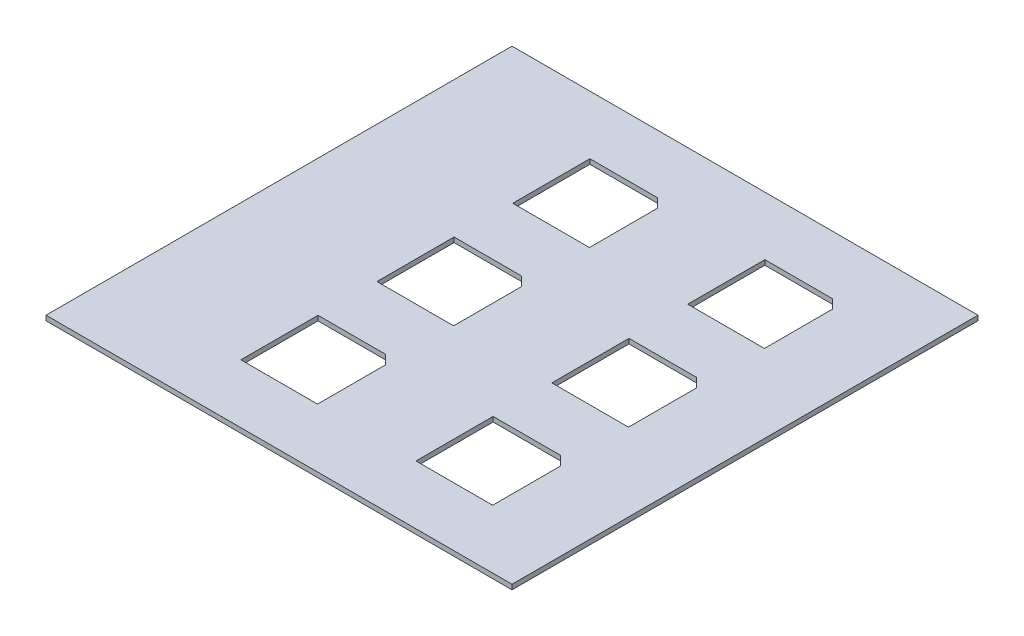
ISO-10303-21;
HEADER;
FILE_DESCRIPTION(('STEP AP214'),'2;1');
FILE_NAME('part.step','',(''),(''),'','','');
FILE_SCHEMA(('AUTOMOTIVE_DESIGN { 1 0 10303 214 1 1 1 1 }'));
ENDSEC;
DATA;
#1=APPLICATION_CONTEXT('core data for automotive mechanical design processes');
#2=APPLICATION_PROTOCOL_DEFINITION('international standard','automotive_design',2000,#1);
#3=PRODUCT_CONTEXT('',#1,'mechanical');
#4=PRODUCT('Part','Part','',(#3));
#5=PRODUCT_RELATED_PRODUCT_CATEGORY('part','',(#4));
#6=PRODUCT_DEFINITION_FORMATION('','',#4);
#7=PRODUCT_DEFINITION_CONTEXT('part definition',#1,'design');
#8=PRODUCT_DEFINITION('design','',#6,#7);
#9=PRODUCT_DEFINITION_SHAPE('','',#8);
#10=(LENGTH_UNIT() NAMED_UNIT(*) SI_UNIT(.MILLI.,.METRE.));
#11=(NAMED_UNIT(*) PLANE_ANGLE_UNIT() SI_UNIT($,.RADIAN.));
#12=(NAMED_UNIT(*) SI_UNIT($,.STERADIAN.) SOLID_ANGLE_UNIT());
#13=UNCERTAINTY_MEASURE_WITH_UNIT(LENGTH_MEASURE(1.E-05),#10,'distance_accuracy_value','');
#14=(GEOMETRIC_REPRESENTATION_CONTEXT(3) GLOBAL_UNCERTAINTY_ASSIGNED_CONTEXT((#13)) GLOBAL_UNIT_ASSIGNED_CONTEXT((#10,
#11,#12)) REPRESENTATION_CONTEXT('',''));
#15=CARTESIAN_POINT('',(0.,0.,0.));
#16=DIRECTION('',(0.,0.,1.));
#17=DIRECTION('',(1.,0.,0.));
#18=AXIS2_PLACEMENT_3D('',#15,#16,#17);
#19=CARTESIAN_POINT('',(0.,3.175,0.));
#20=DIRECTION('',(0.,-1.,0.));
#21=DIRECTION('',(0.,0.,-1.));
#22=AXIS2_PLACEMENT_3D('',#19,#20,#21);
#23=PLANE('',#22);
#24=DIRECTION('',(0.,0.,1.));
#25=VECTOR('',#24,1.);
#26=CARTESIAN_POINT('',(38.6181312538432,3.175,113.973933448569));
#27=LINE('',#26,#25);
#28=CARTESIAN_POINT('',(38.6181312538432,3.175,63.5156232839701));
#29=VERTEX_POINT('',#28);
#30=CARTESIAN_POINT('',(38.6181312538432,3.175,113.973933448569));
#31=VERTEX_POINT('',#30);
#32=EDGE_CURVE('E298',#29,#31,#27,.T.);
#33=ORIENTED_EDGE('',*,*,#32,.F.);
#34=DIRECTION('',(-1.,0.,0.));
#35=VECTOR('',#34,1.);
#36=CARTESIAN_POINT('',(38.6181312538432,3.175,63.5156232839701));
#37=LINE('',#36,#35);
#38=CARTESIAN_POINT('',(82.7586538566415,3.175,63.5156232839701));
#39=VERTEX_POINT('',#38);
#40=EDGE_CURVE('E308',#39,#29,#37,.T.);
#41=ORIENTED_EDGE('',*,*,#40,.F.);
#42=DIRECTION('',(-0.707106781186545,0.,-0.70710678118655));
#43=VECTOR('',#42,1.);
#44=CARTESIAN_POINT('',(82.7586538566415,3.175,63.5156232839701));
#45=LINE('',#44,#43);
#46=CARTESIAN_POINT('',(88.7566843659772,3.175,69.5136537933057));
#47=VERTEX_POINT('',#46);
#48=EDGE_CURVE('E305',#47,#39,#45,.T.);
#49=ORIENTED_EDGE('',*,*,#48,.F.);
#50=DIRECTION('',(0.,0.,-1.));
#51=VECTOR('',#50,1.);
#52=CARTESIAN_POINT('',(88.7566843659772,3.175,113.973933448569));
#53=LINE('',#52,#51);
#54=CARTESIAN_POINT('',(88.7566843659772,3.175,113.973933448569));
#55=VERTEX_POINT('',#54);
#56=EDGE_CURVE('E303',#55,#47,#53,.T.);
#57=ORIENTED_EDGE('',*,*,#56,.F.);
#58=DIRECTION('',(1.,0.,0.));
#59=VECTOR('',#58,1.);
#60=CARTESIAN_POINT('',(38.6181312538432,3.175,113.973933448569));
#61=LINE('',#60,#59);
#62=EDGE_CURVE('E300',#31,#55,#61,.T.);
#63=ORIENTED_EDGE('',*,*,#62,.F.);
#64=EDGE_LOOP('',(#33,#41,#49,#57,#63));
#65=FACE_BOUND('',#64,.T.);
#66=DIRECTION('',(0.,0.,1.));
#67=VECTOR('',#66,1.);
#68=CARTESIAN_POINT('',(-75.7681351800765,3.175,25.1141522078381));
#69=LINE('',#68,#67);
#70=CARTESIAN_POINT('',(-75.7681351800765,3.175,-25.3441579567605));
#71=VERTEX_POINT('',#70);
#72=CARTESIAN_POINT('',(-75.7681351800765,3.175,25.1141522078381));
#73=VERTEX_POINT('',#72);
#74=EDGE_CURVE('E374',#71,#73,#69,.T.);
#75=ORIENTED_EDGE('',*,*,#74,.F.);
#76=DIRECTION('',(-1.,0.,0.));
#77=VECTOR('',#76,1.);
#78=CARTESIAN_POINT('',(-75.7681351800765,3.175,-25.3441579567605));
#79=LINE('',#78,#77);
#80=CARTESIAN_POINT('',(-31.6276125772781,3.175,-25.3441579567605));
#81=VERTEX_POINT('',#80);
#82=EDGE_CURVE('E384',#81,#71,#79,.T.);
#83=ORIENTED_EDGE('',*,*,#82,.F.);
#84=DIRECTION('',(-0.707106781186545,0.,-0.70710678118655));
#85=VECTOR('',#84,1.);
#86=CARTESIAN_POINT('',(-31.6276125772781,3.175,-25.3441579567605));
#87=LINE('',#86,#85);
#88=CARTESIAN_POINT('',(-25.6295820679425,3.175,-19.3461274474248));
#89=VERTEX_POINT('',#88);
#90=EDGE_CURVE('E381',#89,#81,#87,.T.);
#91=ORIENTED_EDGE('',*,*,#90,.F.);
#92=DIRECTION('',(0.,0.,-1.));
#93=VECTOR('',#92,1.);
#94=CARTESIAN_POINT('',(-25.6295820679425,3.175,25.1141522078381));
#95=LINE('',#94,#93);
#96=CARTESIAN_POINT('',(-25.6295820679425,3.175,25.1141522078381));
#97=VERTEX_POINT('',#96);
#98=EDGE_CURVE('E379',#97,#89,#95,.T.);
#99=ORIENTED_EDGE('',*,*,#98,.F.);
#100=DIRECTION('',(1.,0.,0.));
#101=VECTOR('',#100,1.);
#102=CARTESIAN_POINT('',(-75.7681351800765,3.175,25.1141522078381));
#103=LINE('',#102,#101);
#104=EDGE_CURVE('E376',#73,#97,#103,.T.);
#105=ORIENTED_EDGE('',*,*,#104,.F.);
#106=EDGE_LOOP('',(#75,#83,#91,#99,#105));
#107=FACE_BOUND('',#106,.T.);
#108=DIRECTION('',(0.,0.,1.));
#109=VECTOR('',#108,1.);
#110=CARTESIAN_POINT('',(-75.6985006953668,3.175,-63.659947583233));
#111=LINE('',#110,#109);
#112=CARTESIAN_POINT('',(-75.6985006953668,3.175,-114.118257747832));
#113=VERTEX_POINT('',#112);
#114=CARTESIAN_POINT('',(-75.6985006953668,3.175,-63.659947583233));
#115=VERTEX_POINT('',#114);
#116=EDGE_CURVE('E450',#113,#115,#111,.T.);
#117=ORIENTED_EDGE('',*,*,#116,.F.);
#118=DIRECTION('',(-1.,0.,0.));
#119=VECTOR('',#118,1.);
#120=CARTESIAN_POINT('',(-75.6985006953668,3.175,-114.118257747832));
#121=LINE('',#120,#119);
#122=CARTESIAN_POINT('',(-31.5579780925685,3.175,-114.118257747832));
#123=VERTEX_POINT('',#122);
#124=EDGE_CURVE('E460',#123,#113,#121,.T.);
#125=ORIENTED_EDGE('',*,*,#124,.F.);
#126=DIRECTION('',(-0.707106781186545,0.,-0.70710678118655));
#127=VECTOR('',#126,1.);
#128=CARTESIAN_POINT('',(-31.5579780925685,3.175,-114.118257747832));
#129=LINE('',#128,#127);
#130=CARTESIAN_POINT('',(-25.5599475832329,3.175,-108.120227238496));
#131=VERTEX_POINT('',#130);
#132=EDGE_CURVE('E457',#131,#123,#129,.T.);
#133=ORIENTED_EDGE('',*,*,#132,.F.);
#134=DIRECTION('',(0.,0.,-1.));
#135=VECTOR('',#134,1.);
#136=CARTESIAN_POINT('',(-25.5599475832329,3.175,-63.659947583233));
#137=LINE('',#136,#135);
#138=CARTESIAN_POINT('',(-25.5599475832329,3.175,-63.659947583233));
#139=VERTEX_POINT('',#138);
#140=EDGE_CURVE('E455',#139,#131,#137,.T.);
#141=ORIENTED_EDGE('',*,*,#140,.F.);
#142=DIRECTION('',(1.,0.,0.));
#143=VECTOR('',#142,1.);
#144=CARTESIAN_POINT('',(-75.6985006953668,3.175,-63.659947583233));
#145=LINE('',#144,#143);
#146=EDGE_CURVE('E452',#115,#139,#145,.T.);
#147=ORIENTED_EDGE('',*,*,#146,.F.);
#148=EDGE_LOOP('',(#117,#125,#133,#141,#147));
#149=FACE_BOUND('',#148,.T.);
#150=DIRECTION('',(0.,0.,-1.));
#151=VECTOR('',#150,1.);
#152=CARTESIAN_POINT('',(139.859947583233,3.175,152.4));
#153=LINE('',#152,#151);
#154=CARTESIAN_POINT('',(139.859947583233,3.175,152.4));
#155=VERTEX_POINT('',#154);
#156=CARTESIAN_POINT('',(139.859947583233,3.175,-152.4));
#157=VERTEX_POINT('',#156);
#158=EDGE_CURVE('E488',#155,#157,#153,.T.);
#159=ORIENTED_EDGE('',*,*,#158,.T.);
#160=DIRECTION('',(-1.,0.,0.));
#161=VECTOR('',#160,1.);
#162=CARTESIAN_POINT('',(-164.940052416767,3.175,-152.4));
#163=LINE('',#162,#161);
#164=CARTESIAN_POINT('',(-164.940052416767,3.175,-152.4));
#165=VERTEX_POINT('',#164);
#166=EDGE_CURVE('E491',#157,#165,#163,.T.);
#167=ORIENTED_EDGE('',*,*,#166,.T.);
#168=DIRECTION('',(0.,0.,1.));
#169=VECTOR('',#168,1.);
#170=CARTESIAN_POINT('',(-164.940052416767,3.175,152.4));
#171=LINE('',#170,#169);
#172=CARTESIAN_POINT('',(-164.940052416767,3.175,152.4));
#173=VERTEX_POINT('',#172);
#174=EDGE_CURVE('E494',#165,#173,#171,.T.);
#175=ORIENTED_EDGE('',*,*,#174,.T.);
#176=DIRECTION('',(1.,0.,0.));
#177=VECTOR('',#176,1.);
#178=CARTESIAN_POINT('',(-164.940052416767,3.175,152.4));
#179=LINE('',#178,#177);
#180=EDGE_CURVE('E496',#173,#155,#179,.T.);
#181=ORIENTED_EDGE('',*,*,#180,.T.);
#182=EDGE_LOOP('',(#159,#167,#175,#181));
#183=FACE_BOUND('',#182,.T.);
#184=DIRECTION('',(0.,0.,1.));
#185=VECTOR('',#184,1.);
#186=CARTESIAN_POINT('',(38.7016696213254,3.175,-63.70387445682));
#187=LINE('',#186,#185);
#188=CARTESIAN_POINT('',(38.7016696213254,3.175,-114.162184621419));
#189=VERTEX_POINT('',#188);
#190=CARTESIAN_POINT('',(38.7016696213254,3.175,-63.70387445682));
#191=VERTEX_POINT('',#190);
#192=EDGE_CURVE('E412',#189,#191,#187,.T.);
#193=ORIENTED_EDGE('',*,*,#192,.F.);
#194=DIRECTION('',(-1.,0.,0.));
#195=VECTOR('',#194,1.);
#196=CARTESIAN_POINT('',(38.7016696213254,3.175,-114.162184621419));
#197=LINE('',#196,#195);
#198=CARTESIAN_POINT('',(82.8421922241237,3.175,-114.162184621419));
#199=VERTEX_POINT('',#198);
#200=EDGE_CURVE('E422',#199,#189,#197,.T.);
#201=ORIENTED_EDGE('',*,*,#200,.F.);
#202=DIRECTION('',(-0.707106781186545,0.,-0.70710678118655));
#203=VECTOR('',#202,1.);
#204=CARTESIAN_POINT('',(82.8421922241237,3.175,-114.162184621419));
#205=LINE('',#204,#203);
#206=CARTESIAN_POINT('',(88.8402227334593,3.175,-108.164154112083));
#207=VERTEX_POINT('',#206);
#208=EDGE_CURVE('E419',#207,#199,#205,.T.);
#209=ORIENTED_EDGE('',*,*,#208,.F.);
#210=DIRECTION('',(0.,0.,-1.));
#211=VECTOR('',#210,1.);
#212=CARTESIAN_POINT('',(88.8402227334593,3.175,-63.70387445682));
#213=LINE('',#212,#211);
#214=CARTESIAN_POINT('',(88.8402227334593,3.175,-63.70387445682));
#215=VERTEX_POINT('',#214);
#216=EDGE_CURVE('E417',#215,#207,#213,.T.);
#217=ORIENTED_EDGE('',*,*,#216,.F.);
#218=DIRECTION('',(1.,0.,0.));
#219=VECTOR('',#218,1.);
#220=CARTESIAN_POINT('',(38.7016696213254,3.175,-63.70387445682));
#221=LINE('',#220,#219);
#222=EDGE_CURVE('E414',#191,#215,#221,.T.);
#223=ORIENTED_EDGE('',*,*,#222,.F.);
#224=EDGE_LOOP('',(#193,#201,#209,#217,#223));
#225=FACE_BOUND('',#224,.T.);
#226=DIRECTION('',(0.,0.,1.));
#227=VECTOR('',#226,1.);
#228=CARTESIAN_POINT('',(38.837246674097,3.175,25.3138517502849));
#229=LINE('',#228,#227);
#230=CARTESIAN_POINT('',(38.837246674097,3.175,-25.1444584143138));
#231=VERTEX_POINT('',#230);
#232=CARTESIAN_POINT('',(38.837246674097,3.175,25.3138517502849));
#233=VERTEX_POINT('',#232);
#234=EDGE_CURVE('E336',#231,#233,#229,.T.);
#235=ORIENTED_EDGE('',*,*,#234,.F.);
#236=DIRECTION('',(-1.,0.,0.));
#237=VECTOR('',#236,1.);
#238=CARTESIAN_POINT('',(38.837246674097,3.175,-25.1444584143138));
#239=LINE('',#238,#237);
#240=CARTESIAN_POINT('',(82.9777692768953,3.175,-25.1444584143138));
#241=VERTEX_POINT('',#240);
#242=EDGE_CURVE('E346',#241,#231,#239,.T.);
#243=ORIENTED_EDGE('',*,*,#242,.F.);
#244=DIRECTION('',(-0.707106781186546,0.,-0.707106781186549));
#245=VECTOR('',#244,1.);
#246=CARTESIAN_POINT('',(82.9777692768953,3.175,-25.1444584143138));
#247=LINE('',#246,#245);
#248=CARTESIAN_POINT('',(88.975799786231,3.175,-19.1464279049781));
#249=VERTEX_POINT('',#248);
#250=EDGE_CURVE('E343',#249,#241,#247,.T.);
#251=ORIENTED_EDGE('',*,*,#250,.F.);
#252=DIRECTION('',(0.,0.,-1.));
#253=VECTOR('',#252,1.);
#254=CARTESIAN_POINT('',(88.975799786231,3.175,25.3138517502849));
#255=LINE('',#254,#253);
#256=CARTESIAN_POINT('',(88.975799786231,3.175,25.3138517502849));
#257=VERTEX_POINT('',#256);
#258=EDGE_CURVE('E341',#257,#249,#255,.T.);
#259=ORIENTED_EDGE('',*,*,#258,.F.);
#260=DIRECTION('',(1.,0.,0.));
#261=VECTOR('',#260,1.);
#262=CARTESIAN_POINT('',(38.837246674097,3.175,25.3138517502849));
#263=LINE('',#262,#261);
#264=EDGE_CURVE('E338',#233,#257,#263,.T.);
#265=ORIENTED_EDGE('',*,*,#264,.F.);
#266=EDGE_LOOP('',(#235,#243,#251,#259,#265));
#267=FACE_BOUND('',#266,.T.);
#268=DIRECTION('',(0.,0.,1.));
#269=VECTOR('',#268,1.);
#270=CARTESIAN_POINT('',(-75.9260776330106,3.175,113.955197725837));
#271=LINE('',#270,#269);
#272=CARTESIAN_POINT('',(-75.9260776330106,3.175,63.4968875612388));
#273=VERTEX_POINT('',#272);
#274=CARTESIAN_POINT('',(-75.9260776330106,3.175,113.955197725837));
#275=VERTEX_POINT('',#274);
#276=EDGE_CURVE('E254',#273,#275,#271,.T.);
#277=ORIENTED_EDGE('',*,*,#276,.F.);
#278=DIRECTION('',(-1.,0.,0.));
#279=VECTOR('',#278,1.);
#280=CARTESIAN_POINT('',(-75.9260776330106,3.175,63.4968875612388));
#281=LINE('',#280,#279);
#282=CARTESIAN_POINT('',(-31.7855550302123,3.175,63.4968875612388));
#283=VERTEX_POINT('',#282);
#284=EDGE_CURVE('E281',#283,#273,#281,.T.);
#285=ORIENTED_EDGE('',*,*,#284,.F.);
#286=DIRECTION('',(-0.707106781186545,0.,-0.70710678118655));
#287=VECTOR('',#286,1.);
#288=CARTESIAN_POINT('',(-31.7855550302123,3.175,63.4968875612388));
#289=LINE('',#288,#287);
#290=CARTESIAN_POINT('',(-25.7875245208766,3.175,69.4949180705745));
#291=VERTEX_POINT('',#290);
#292=EDGE_CURVE('E277',#291,#283,#289,.T.);
#293=ORIENTED_EDGE('',*,*,#292,.F.);
#294=DIRECTION('',(0.,0.,-1.));
#295=VECTOR('',#294,1.);
#296=CARTESIAN_POINT('',(-25.7875245208766,3.175,113.955197725837));
#297=LINE('',#296,#295);
#298=CARTESIAN_POINT('',(-25.7875245208766,3.175,113.955197725837));
#299=VERTEX_POINT('',#298);
#300=EDGE_CURVE('E275',#299,#291,#297,.T.);
#301=ORIENTED_EDGE('',*,*,#300,.F.);
#302=DIRECTION('',(1.,0.,0.));
#303=VECTOR('',#302,1.);
#304=CARTESIAN_POINT('',(-75.9260776330106,3.175,113.955197725837));
#305=LINE('',#304,#303);
#306=EDGE_CURVE('E262',#275,#299,#305,.T.);
#307=ORIENTED_EDGE('',*,*,#306,.F.);
#308=EDGE_LOOP('',(#277,#285,#293,#301,#307));
#309=FACE_BOUND('',#308,.T.);
#310=ADVANCED_FACE('F33',(#65,#107,#149,#183,#225,#267,#309),#23,.F.);
#311=CARTESIAN_POINT('',(0.,0.,0.));
#312=DIRECTION('',(0.,-1.,0.));
#313=DIRECTION('',(0.,0.,-1.));
#314=AXIS2_PLACEMENT_3D('',#311,#312,#313);
#315=PLANE('',#314);
#316=DIRECTION('',(0.,0.,-1.));
#317=VECTOR('',#316,1.);
#318=CARTESIAN_POINT('',(139.859947583233,0.,152.4));
#319=LINE('',#318,#317);
#320=CARTESIAN_POINT('',(139.859947583233,0.,152.4));
#321=VERTEX_POINT('',#320);
#322=CARTESIAN_POINT('',(139.859947583233,0.,-152.4));
#323=VERTEX_POINT('',#322);
#324=EDGE_CURVE('E487',#321,#323,#319,.T.);
#325=ORIENTED_EDGE('',*,*,#324,.F.);
#326=DIRECTION('',(1.,0.,0.));
#327=VECTOR('',#326,1.);
#328=CARTESIAN_POINT('',(-164.940052416767,0.,152.4));
#329=LINE('',#328,#327);
#330=CARTESIAN_POINT('',(-164.940052416767,0.,152.4));
#331=VERTEX_POINT('',#330);
#332=EDGE_CURVE('E492',#331,#321,#329,.T.);
#333=ORIENTED_EDGE('',*,*,#332,.F.);
#334=DIRECTION('',(0.,0.,1.));
#335=VECTOR('',#334,1.);
#336=CARTESIAN_POINT('',(-164.940052416767,0.,152.4));
#337=LINE('',#336,#335);
#338=CARTESIAN_POINT('',(-164.940052416767,0.,-152.4));
#339=VERTEX_POINT('',#338);
#340=EDGE_CURVE('E503',#339,#331,#337,.T.);
#341=ORIENTED_EDGE('',*,*,#340,.F.);
#342=DIRECTION('',(-1.,0.,0.));
#343=VECTOR('',#342,1.);
#344=CARTESIAN_POINT('',(-164.940052416767,0.,-152.4));
#345=LINE('',#344,#343);
#346=EDGE_CURVE('E501',#323,#339,#345,.T.);
#347=ORIENTED_EDGE('',*,*,#346,.F.);
#348=EDGE_LOOP('',(#325,#333,#341,#347));
#349=FACE_BOUND('',#348,.T.);
#350=DIRECTION('',(-1.,0.,0.));
#351=VECTOR('',#350,1.);
#352=CARTESIAN_POINT('',(-75.6985006953668,0.,-114.118257747832));
#353=LINE('',#352,#351);
#354=CARTESIAN_POINT('',(-31.5579780925685,0.,-114.118257747832));
#355=VERTEX_POINT('',#354);
#356=CARTESIAN_POINT('',(-75.6985006953668,0.,-114.118257747832));
#357=VERTEX_POINT('',#356);
#358=EDGE_CURVE('E453',#355,#357,#353,.T.);
#359=ORIENTED_EDGE('',*,*,#358,.T.);
#360=DIRECTION('',(0.,0.,1.));
#361=VECTOR('',#360,1.);
#362=CARTESIAN_POINT('',(-75.6985006953668,0.,-63.659947583233));
#363=LINE('',#362,#361);
#364=CARTESIAN_POINT('',(-75.6985006953668,0.,-63.659947583233));
#365=VERTEX_POINT('',#364);
#366=EDGE_CURVE('E449',#357,#365,#363,.T.);
#367=ORIENTED_EDGE('',*,*,#366,.T.);
#368=DIRECTION('',(1.,0.,0.));
#369=VECTOR('',#368,1.);
#370=CARTESIAN_POINT('',(-75.6985006953668,0.,-63.659947583233));
#371=LINE('',#370,#369);
#372=CARTESIAN_POINT('',(-25.5599475832329,0.,-63.659947583233));
#373=VERTEX_POINT('',#372);
#374=EDGE_CURVE('E465',#365,#373,#371,.T.);
#375=ORIENTED_EDGE('',*,*,#374,.T.);
#376=DIRECTION('',(0.,0.,-1.));
#377=VECTOR('',#376,1.);
#378=CARTESIAN_POINT('',(-25.5599475832329,0.,-63.659947583233));
#379=LINE('',#378,#377);
#380=CARTESIAN_POINT('',(-25.5599475832329,0.,-108.120227238496));
#381=VERTEX_POINT('',#380);
#382=EDGE_CURVE('E468',#373,#381,#379,.T.);
#383=ORIENTED_EDGE('',*,*,#382,.T.);
#384=DIRECTION('',(-0.707106781186545,0.,-0.70710678118655));
#385=VECTOR('',#384,1.);
#386=CARTESIAN_POINT('',(-31.5579780925685,0.,-114.118257747832));
#387=LINE('',#386,#385);
#388=EDGE_CURVE('E471',#381,#355,#387,.T.);
#389=ORIENTED_EDGE('',*,*,#388,.T.);
#390=EDGE_LOOP('',(#359,#367,#375,#383,#389));
#391=FACE_BOUND('',#390,.T.);
#392=DIRECTION('',(-1.,0.,0.));
#393=VECTOR('',#392,1.);
#394=CARTESIAN_POINT('',(38.7016696213254,0.,-114.162184621419));
#395=LINE('',#394,#393);
#396=CARTESIAN_POINT('',(82.8421922241237,0.,-114.162184621419));
#397=VERTEX_POINT('',#396);
#398=CARTESIAN_POINT('',(38.7016696213254,0.,-114.162184621419));
#399=VERTEX_POINT('',#398);
#400=EDGE_CURVE('E415',#397,#399,#395,.T.);
#401=ORIENTED_EDGE('',*,*,#400,.T.);
#402=DIRECTION('',(0.,0.,1.));
#403=VECTOR('',#402,1.);
#404=CARTESIAN_POINT('',(38.7016696213254,0.,-63.70387445682));
#405=LINE('',#404,#403);
#406=CARTESIAN_POINT('',(38.7016696213254,0.,-63.70387445682));
#407=VERTEX_POINT('',#406);
#408=EDGE_CURVE('E411',#399,#407,#405,.T.);
#409=ORIENTED_EDGE('',*,*,#408,.T.);
#410=DIRECTION('',(1.,0.,0.));
#411=VECTOR('',#410,1.);
#412=CARTESIAN_POINT('',(38.7016696213254,0.,-63.70387445682));
#413=LINE('',#412,#411);
#414=CARTESIAN_POINT('',(88.8402227334593,0.,-63.70387445682));
#415=VERTEX_POINT('',#414);
#416=EDGE_CURVE('E427',#407,#415,#413,.T.);
#417=ORIENTED_EDGE('',*,*,#416,.T.);
#418=DIRECTION('',(0.,0.,-1.));
#419=VECTOR('',#418,1.);
#420=CARTESIAN_POINT('',(88.8402227334593,0.,-63.70387445682));
#421=LINE('',#420,#419);
#422=CARTESIAN_POINT('',(88.8402227334593,0.,-108.164154112083));
#423=VERTEX_POINT('',#422);
#424=EDGE_CURVE('E430',#415,#423,#421,.T.);
#425=ORIENTED_EDGE('',*,*,#424,.T.);
#426=DIRECTION('',(-0.707106781186545,0.,-0.70710678118655));
#427=VECTOR('',#426,1.);
#428=CARTESIAN_POINT('',(82.8421922241237,0.,-114.162184621419));
#429=LINE('',#428,#427);
#430=EDGE_CURVE('E433',#423,#397,#429,.T.);
#431=ORIENTED_EDGE('',*,*,#430,.T.);
#432=EDGE_LOOP('',(#401,#409,#417,#425,#431));
#433=FACE_BOUND('',#432,.T.);
#434=DIRECTION('',(-1.,0.,0.));
#435=VECTOR('',#434,1.);
#436=CARTESIAN_POINT('',(-75.7681351800765,0.,-25.3441579567605));
#437=LINE('',#436,#435);
#438=CARTESIAN_POINT('',(-31.6276125772781,0.,-25.3441579567605));
#439=VERTEX_POINT('',#438);
#440=CARTESIAN_POINT('',(-75.7681351800765,0.,-25.3441579567605));
#441=VERTEX_POINT('',#440);
#442=EDGE_CURVE('E377',#439,#441,#437,.T.);
#443=ORIENTED_EDGE('',*,*,#442,.T.);
#444=DIRECTION('',(0.,0.,1.));
#445=VECTOR('',#444,1.);
#446=CARTESIAN_POINT('',(-75.7681351800765,0.,25.1141522078381));
#447=LINE('',#446,#445);
#448=CARTESIAN_POINT('',(-75.7681351800765,0.,25.1141522078381));
#449=VERTEX_POINT('',#448);
#450=EDGE_CURVE('E373',#441,#449,#447,.T.);
#451=ORIENTED_EDGE('',*,*,#450,.T.);
#452=DIRECTION('',(1.,0.,0.));
#453=VECTOR('',#452,1.);
#454=CARTESIAN_POINT('',(-75.7681351800765,0.,25.1141522078381));
#455=LINE('',#454,#453);
#456=CARTESIAN_POINT('',(-25.6295820679425,0.,25.1141522078381));
#457=VERTEX_POINT('',#456);
#458=EDGE_CURVE('E389',#449,#457,#455,.T.);
#459=ORIENTED_EDGE('',*,*,#458,.T.);
#460=DIRECTION('',(0.,0.,-1.));
#461=VECTOR('',#460,1.);
#462=CARTESIAN_POINT('',(-25.6295820679425,0.,25.1141522078381));
#463=LINE('',#462,#461);
#464=CARTESIAN_POINT('',(-25.6295820679425,0.,-19.3461274474248));
#465=VERTEX_POINT('',#464);
#466=EDGE_CURVE('E392',#457,#465,#463,.T.);
#467=ORIENTED_EDGE('',*,*,#466,.T.);
#468=DIRECTION('',(-0.707106781186545,0.,-0.70710678118655));
#469=VECTOR('',#468,1.);
#470=CARTESIAN_POINT('',(-31.6276125772781,0.,-25.3441579567605));
#471=LINE('',#470,#469);
#472=EDGE_CURVE('E395',#465,#439,#471,.T.);
#473=ORIENTED_EDGE('',*,*,#472,.T.);
#474=EDGE_LOOP('',(#443,#451,#459,#467,#473));
#475=FACE_BOUND('',#474,.T.);
#476=DIRECTION('',(-1.,0.,0.));
#477=VECTOR('',#476,1.);
#478=CARTESIAN_POINT('',(38.837246674097,0.,-25.1444584143138));
#479=LINE('',#478,#477);
#480=CARTESIAN_POINT('',(82.9777692768953,0.,-25.1444584143138));
#481=VERTEX_POINT('',#480);
#482=CARTESIAN_POINT('',(38.837246674097,0.,-25.1444584143138));
#483=VERTEX_POINT('',#482);
#484=EDGE_CURVE('E339',#481,#483,#479,.T.);
#485=ORIENTED_EDGE('',*,*,#484,.T.);
#486=DIRECTION('',(0.,0.,1.));
#487=VECTOR('',#486,1.);
#488=CARTESIAN_POINT('',(38.837246674097,0.,25.3138517502849));
#489=LINE('',#488,#487);
#490=CARTESIAN_POINT('',(38.837246674097,0.,25.3138517502849));
#491=VERTEX_POINT('',#490);
#492=EDGE_CURVE('E335',#483,#491,#489,.T.);
#493=ORIENTED_EDGE('',*,*,#492,.T.);
#494=DIRECTION('',(1.,0.,0.));
#495=VECTOR('',#494,1.);
#496=CARTESIAN_POINT('',(38.837246674097,0.,25.3138517502849));
#497=LINE('',#496,#495);
#498=CARTESIAN_POINT('',(88.975799786231,0.,25.3138517502849));
#499=VERTEX_POINT('',#498);
#500=EDGE_CURVE('E351',#491,#499,#497,.T.);
#501=ORIENTED_EDGE('',*,*,#500,.T.);
#502=DIRECTION('',(0.,0.,-1.));
#503=VECTOR('',#502,1.);
#504=CARTESIAN_POINT('',(88.975799786231,0.,25.3138517502849));
#505=LINE('',#504,#503);
#506=CARTESIAN_POINT('',(88.975799786231,0.,-19.1464279049781));
#507=VERTEX_POINT('',#506);
#508=EDGE_CURVE('E354',#499,#507,#505,.T.);
#509=ORIENTED_EDGE('',*,*,#508,.T.);
#510=DIRECTION('',(-0.707106781186546,0.,-0.707106781186549));
#511=VECTOR('',#510,1.);
#512=CARTESIAN_POINT('',(82.9777692768953,0.,-25.1444584143138));
#513=LINE('',#512,#511);
#514=EDGE_CURVE('E357',#507,#481,#513,.T.);
#515=ORIENTED_EDGE('',*,*,#514,.T.);
#516=EDGE_LOOP('',(#485,#493,#501,#509,#515));
#517=FACE_BOUND('',#516,.T.);
#518=DIRECTION('',(-1.,0.,0.));
#519=VECTOR('',#518,1.);
#520=CARTESIAN_POINT('',(38.6181312538432,0.,63.5156232839701));
#521=LINE('',#520,#519);
#522=CARTESIAN_POINT('',(82.7586538566415,0.,63.5156232839701));
#523=VERTEX_POINT('',#522);
#524=CARTESIAN_POINT('',(38.6181312538432,0.,63.5156232839701));
#525=VERTEX_POINT('',#524);
#526=EDGE_CURVE('E301',#523,#525,#521,.T.);
#527=ORIENTED_EDGE('',*,*,#526,.T.);
#528=DIRECTION('',(0.,0.,1.));
#529=VECTOR('',#528,1.);
#530=CARTESIAN_POINT('',(38.6181312538432,0.,113.973933448569));
#531=LINE('',#530,#529);
#532=CARTESIAN_POINT('',(38.6181312538432,0.,113.973933448569));
#533=VERTEX_POINT('',#532);
#534=EDGE_CURVE('E270',#525,#533,#531,.T.);
#535=ORIENTED_EDGE('',*,*,#534,.T.);
#536=DIRECTION('',(1.,0.,0.));
#537=VECTOR('',#536,1.);
#538=CARTESIAN_POINT('',(38.6181312538432,0.,113.973933448569));
#539=LINE('',#538,#537);
#540=CARTESIAN_POINT('',(88.7566843659772,0.,113.973933448569));
#541=VERTEX_POINT('',#540);
#542=EDGE_CURVE('E313',#533,#541,#539,.T.);
#543=ORIENTED_EDGE('',*,*,#542,.T.);
#544=DIRECTION('',(0.,0.,-1.));
#545=VECTOR('',#544,1.);
#546=CARTESIAN_POINT('',(88.7566843659772,0.,113.973933448569));
#547=LINE('',#546,#545);
#548=CARTESIAN_POINT('',(88.7566843659772,0.,69.5136537933057));
#549=VERTEX_POINT('',#548);
#550=EDGE_CURVE('E316',#541,#549,#547,.T.);
#551=ORIENTED_EDGE('',*,*,#550,.T.);
#552=DIRECTION('',(-0.707106781186545,0.,-0.70710678118655));
#553=VECTOR('',#552,1.);
#554=CARTESIAN_POINT('',(82.7586538566415,0.,63.5156232839701));
#555=LINE('',#554,#553);
#556=EDGE_CURVE('E319',#549,#523,#555,.T.);
#557=ORIENTED_EDGE('',*,*,#556,.T.);
#558=EDGE_LOOP('',(#527,#535,#543,#551,#557));
#559=FACE_BOUND('',#558,.T.);
#560=DIRECTION('',(-1.,0.,0.));
#561=VECTOR('',#560,1.);
#562=CARTESIAN_POINT('',(-75.9260776330106,0.,63.4968875612388));
#563=LINE('',#562,#561);
#564=CARTESIAN_POINT('',(-31.7855550302123,0.,63.4968875612388));
#565=VERTEX_POINT('',#564);
#566=CARTESIAN_POINT('',(-75.9260776330106,0.,63.4968875612388));
#567=VERTEX_POINT('',#566);
#568=EDGE_CURVE('E263',#565,#567,#563,.T.);
#569=ORIENTED_EDGE('',*,*,#568,.T.);
#570=DIRECTION('',(0.,0.,1.));
#571=VECTOR('',#570,1.);
#572=CARTESIAN_POINT('',(-75.9260776330106,0.,113.955197725837));
#573=LINE('',#572,#571);
#574=CARTESIAN_POINT('',(-75.9260776330106,0.,113.955197725837));
#575=VERTEX_POINT('',#574);
#576=EDGE_CURVE('E56',#567,#575,#573,.T.);
#577=ORIENTED_EDGE('',*,*,#576,.T.);
#578=DIRECTION('',(1.,0.,0.));
#579=VECTOR('',#578,1.);
#580=CARTESIAN_POINT('',(-75.9260776330106,0.,113.955197725837));
#581=LINE('',#580,#579);
#582=CARTESIAN_POINT('',(-25.7875245208766,0.,113.955197725837));
#583=VERTEX_POINT('',#582);
#584=EDGE_CURVE('E269',#575,#583,#581,.T.);
#585=ORIENTED_EDGE('',*,*,#584,.T.);
#586=DIRECTION('',(0.,0.,-1.));
#587=VECTOR('',#586,1.);
#588=CARTESIAN_POINT('',(-25.7875245208766,0.,113.955197725837));
#589=LINE('',#588,#587);
#590=CARTESIAN_POINT('',(-25.7875245208766,0.,69.4949180705745));
#591=VERTEX_POINT('',#590);
#592=EDGE_CURVE('E285',#583,#591,#589,.T.);
#593=ORIENTED_EDGE('',*,*,#592,.T.);
#594=DIRECTION('',(-0.707106781186545,0.,-0.70710678118655));
#595=VECTOR('',#594,1.);
#596=CARTESIAN_POINT('',(-31.7855550302123,0.,63.4968875612388));
#597=LINE('',#596,#595);
#598=EDGE_CURVE('E288',#591,#565,#597,.T.);
#599=ORIENTED_EDGE('',*,*,#598,.T.);
#600=EDGE_LOOP('',(#569,#577,#585,#593,#599));
#601=FACE_BOUND('',#600,.T.);
#602=ADVANCED_FACE('F521',(#349,#391,#433,#475,#517,#559,#601),#315,.T.);
#603=CARTESIAN_POINT('',(139.859947583233,3.175,152.4));
#604=DIRECTION('',(-1.,0.,0.));
#605=DIRECTION('',(0.,0.,1.));
#606=AXIS2_PLACEMENT_3D('',#603,#604,#605);
#607=PLANE('',#606);
#608=ORIENTED_EDGE('',*,*,#324,.T.);
#609=DIRECTION('',(0.,-1.,0.));
#610=VECTOR('',#609,1.);
#611=CARTESIAN_POINT('',(139.859947583233,3.175,-152.4));
#612=LINE('',#611,#610);
#613=EDGE_CURVE('E11',#157,#323,#612,.T.);
#614=ORIENTED_EDGE('',*,*,#613,.F.);
#615=ORIENTED_EDGE('',*,*,#158,.F.);
#616=DIRECTION('',(0.,-1.,0.));
#617=VECTOR('',#616,1.);
#618=CARTESIAN_POINT('',(139.859947583233,3.175,152.4));
#619=LINE('',#618,#617);
#620=EDGE_CURVE('E498',#155,#321,#619,.T.);
#621=ORIENTED_EDGE('',*,*,#620,.T.);
#622=EDGE_LOOP('',(#608,#614,#615,#621));
#623=FACE_BOUND('',#622,.T.);
#624=ADVANCED_FACE('F35',(#623),#607,.F.);
#625=CARTESIAN_POINT('',(-164.940052416767,3.175,-152.4));
#626=DIRECTION('',(0.,0.,1.));
#627=DIRECTION('',(1.,0.,0.));
#628=AXIS2_PLACEMENT_3D('',#625,#626,#627);
#629=PLANE('',#628);
#630=ORIENTED_EDGE('',*,*,#346,.T.);
#631=DIRECTION('',(0.,-1.,0.));
#632=VECTOR('',#631,1.);
#633=CARTESIAN_POINT('',(-164.940052416767,3.175,-152.4));
#634=LINE('',#633,#632);
#635=EDGE_CURVE('E41',#165,#339,#634,.T.);
#636=ORIENTED_EDGE('',*,*,#635,.F.);
#637=ORIENTED_EDGE('',*,*,#166,.F.);
#638=ORIENTED_EDGE('',*,*,#613,.T.);
#639=EDGE_LOOP('',(#630,#636,#637,#638));
#640=FACE_BOUND('',#639,.T.);
#641=ADVANCED_FACE('F532',(#640),#629,.F.);
#642=CARTESIAN_POINT('',(-164.940052416767,3.175,152.4));
#643=DIRECTION('',(1.,0.,0.));
#644=DIRECTION('',(0.,0.,-1.));
#645=AXIS2_PLACEMENT_3D('',#642,#643,#644);
#646=PLANE('',#645);
#647=ORIENTED_EDGE('',*,*,#340,.T.);
#648=DIRECTION('',(0.,-1.,0.));
#649=VECTOR('',#648,1.);
#650=CARTESIAN_POINT('',(-164.940052416767,3.175,152.4));
#651=LINE('',#650,#649);
#652=EDGE_CURVE('E508',#173,#331,#651,.T.);
#653=ORIENTED_EDGE('',*,*,#652,.F.);
#654=ORIENTED_EDGE('',*,*,#174,.F.);
#655=ORIENTED_EDGE('',*,*,#635,.T.);
#656=EDGE_LOOP('',(#647,#653,#654,#655));
#657=FACE_BOUND('',#656,.T.);
#658=ADVANCED_FACE('F515',(#657),#646,.F.);
#659=CARTESIAN_POINT('',(-164.940052416767,3.175,152.4));
#660=DIRECTION('',(0.,0.,-1.));
#661=DIRECTION('',(-1.,0.,0.));
#662=AXIS2_PLACEMENT_3D('',#659,#660,#661);
#663=PLANE('',#662);
#664=ORIENTED_EDGE('',*,*,#332,.T.);
#665=ORIENTED_EDGE('',*,*,#620,.F.);
#666=ORIENTED_EDGE('',*,*,#180,.F.);
#667=ORIENTED_EDGE('',*,*,#652,.T.);
#668=EDGE_LOOP('',(#664,#665,#666,#667));
#669=FACE_BOUND('',#668,.T.);
#670=ADVANCED_FACE('F525',(#669),#663,.F.);
#671=CARTESIAN_POINT('',(-75.6985006953668,3.175,-63.659947583233));
#672=DIRECTION('',(1.,0.,0.));
#673=DIRECTION('',(0.,0.,-1.));
#674=AXIS2_PLACEMENT_3D('',#671,#672,#673);
#675=PLANE('',#674);
#676=ORIENTED_EDGE('',*,*,#366,.F.);
#677=DIRECTION('',(0.,-1.,0.));
#678=VECTOR('',#677,1.);
#679=CARTESIAN_POINT('',(-75.6985006953668,3.175,-114.118257747832));
#680=LINE('',#679,#678);
#681=EDGE_CURVE('E462',#113,#357,#680,.T.);
#682=ORIENTED_EDGE('',*,*,#681,.F.);
#683=ORIENTED_EDGE('',*,*,#116,.T.);
#684=DIRECTION('',(0.,-1.,0.));
#685=VECTOR('',#684,1.);
#686=CARTESIAN_POINT('',(-75.6985006953668,3.175,-63.659947583233));
#687=LINE('',#686,#685);
#688=EDGE_CURVE('E484',#115,#365,#687,.T.);
#689=ORIENTED_EDGE('',*,*,#688,.T.);
#690=EDGE_LOOP('',(#676,#682,#683,#689));
#691=FACE_BOUND('',#690,.T.);
#692=ADVANCED_FACE('F549',(#691),#675,.T.);
#693=CARTESIAN_POINT('',(-75.6985006953668,3.175,-63.659947583233));
#694=DIRECTION('',(0.,0.,-1.));
#695=DIRECTION('',(-1.,0.,0.));
#696=AXIS2_PLACEMENT_3D('',#693,#694,#695);
#697=PLANE('',#696);
#698=ORIENTED_EDGE('',*,*,#374,.F.);
#699=ORIENTED_EDGE('',*,*,#688,.F.);
#700=ORIENTED_EDGE('',*,*,#146,.T.);
#701=DIRECTION('',(0.,-1.,0.));
#702=VECTOR('',#701,1.);
#703=CARTESIAN_POINT('',(-25.5599475832329,3.175,-63.659947583233));
#704=LINE('',#703,#702);
#705=EDGE_CURVE('E482',#139,#373,#704,.T.);
#706=ORIENTED_EDGE('',*,*,#705,.T.);
#707=EDGE_LOOP('',(#698,#699,#700,#706));
#708=FACE_BOUND('',#707,.T.);
#709=ADVANCED_FACE('F556',(#708),#697,.T.);
#710=CARTESIAN_POINT('',(-25.5599475832329,3.175,-63.659947583233));
#711=DIRECTION('',(-1.,0.,0.));
#712=DIRECTION('',(0.,0.,1.));
#713=AXIS2_PLACEMENT_3D('',#710,#711,#712);
#714=PLANE('',#713);
#715=ORIENTED_EDGE('',*,*,#382,.F.);
#716=ORIENTED_EDGE('',*,*,#705,.F.);
#717=ORIENTED_EDGE('',*,*,#140,.T.);
#718=DIRECTION('',(0.,-1.,0.));
#719=VECTOR('',#718,1.);
#720=CARTESIAN_POINT('',(-25.5599475832329,3.175,-108.120227238496));
#721=LINE('',#720,#719);
#722=EDGE_CURVE('E480',#131,#381,#721,.T.);
#723=ORIENTED_EDGE('',*,*,#722,.T.);
#724=EDGE_LOOP('',(#715,#716,#717,#723));
#725=FACE_BOUND('',#724,.T.);
#726=ADVANCED_FACE('F561',(#725),#714,.T.);
#727=CARTESIAN_POINT('',(-31.5579780925685,3.175,-114.118257747832));
#728=DIRECTION('',(-0.707106781186549,0.,0.707106781186545));
#729=DIRECTION('',(0.707106781186545,0.,0.70710678118655));
#730=AXIS2_PLACEMENT_3D('',#727,#728,#729);
#731=PLANE('',#730);
#732=ORIENTED_EDGE('',*,*,#388,.F.);
#733=ORIENTED_EDGE('',*,*,#722,.F.);
#734=ORIENTED_EDGE('',*,*,#132,.T.);
#735=DIRECTION('',(0.,-1.,0.));
#736=VECTOR('',#735,1.);
#737=CARTESIAN_POINT('',(-31.5579780925685,3.175,-114.118257747832));
#738=LINE('',#737,#736);
#739=EDGE_CURVE('E478',#123,#355,#738,.T.);
#740=ORIENTED_EDGE('',*,*,#739,.T.);
#741=EDGE_LOOP('',(#732,#733,#734,#740));
#742=FACE_BOUND('',#741,.T.);
#743=ADVANCED_FACE('F575',(#742),#731,.T.);
#744=CARTESIAN_POINT('',(-75.6985006953668,3.175,-114.118257747832));
#745=DIRECTION('',(0.,0.,1.));
#746=DIRECTION('',(1.,0.,0.));
#747=AXIS2_PLACEMENT_3D('',#744,#745,#746);
#748=PLANE('',#747);
#749=ORIENTED_EDGE('',*,*,#358,.F.);
#750=ORIENTED_EDGE('',*,*,#739,.F.);
#751=ORIENTED_EDGE('',*,*,#124,.T.);
#752=ORIENTED_EDGE('',*,*,#681,.T.);
#753=EDGE_LOOP('',(#749,#750,#751,#752));
#754=FACE_BOUND('',#753,.T.);
#755=ADVANCED_FACE('F568',(#754),#748,.T.);
#756=CARTESIAN_POINT('',(38.7016696213254,3.175,-63.70387445682));
#757=DIRECTION('',(1.,0.,0.));
#758=DIRECTION('',(0.,0.,-1.));
#759=AXIS2_PLACEMENT_3D('',#756,#757,#758);
#760=PLANE('',#759);
#761=ORIENTED_EDGE('',*,*,#408,.F.);
#762=DIRECTION('',(0.,-1.,0.));
#763=VECTOR('',#762,1.);
#764=CARTESIAN_POINT('',(38.7016696213254,3.175,-114.162184621419));
#765=LINE('',#764,#763);
#766=EDGE_CURVE('E424',#189,#399,#765,.T.);
#767=ORIENTED_EDGE('',*,*,#766,.F.);
#768=ORIENTED_EDGE('',*,*,#192,.T.);
#769=DIRECTION('',(0.,-1.,0.));
#770=VECTOR('',#769,1.);
#771=CARTESIAN_POINT('',(38.7016696213254,3.175,-63.70387445682));
#772=LINE('',#771,#770);
#773=EDGE_CURVE('E446',#191,#407,#772,.T.);
#774=ORIENTED_EDGE('',*,*,#773,.T.);
#775=EDGE_LOOP('',(#761,#767,#768,#774));
#776=FACE_BOUND('',#775,.T.);
#777=ADVANCED_FACE('F591',(#776),#760,.T.);
#778=CARTESIAN_POINT('',(38.7016696213254,3.175,-63.70387445682));
#779=DIRECTION('',(0.,0.,-1.));
#780=DIRECTION('',(-1.,0.,0.));
#781=AXIS2_PLACEMENT_3D('',#778,#779,#780);
#782=PLANE('',#781);
#783=ORIENTED_EDGE('',*,*,#416,.F.);
#784=ORIENTED_EDGE('',*,*,#773,.F.);
#785=ORIENTED_EDGE('',*,*,#222,.T.);
#786=DIRECTION('',(0.,-1.,0.));
#787=VECTOR('',#786,1.);
#788=CARTESIAN_POINT('',(88.8402227334593,3.175,-63.70387445682));
#789=LINE('',#788,#787);
#790=EDGE_CURVE('E444',#215,#415,#789,.T.);
#791=ORIENTED_EDGE('',*,*,#790,.T.);
#792=EDGE_LOOP('',(#783,#784,#785,#791));
#793=FACE_BOUND('',#792,.T.);
#794=ADVANCED_FACE('F594',(#793),#782,.T.);
#795=CARTESIAN_POINT('',(88.8402227334593,3.175,-63.70387445682));
#796=DIRECTION('',(-1.,0.,0.));
#797=DIRECTION('',(0.,0.,1.));
#798=AXIS2_PLACEMENT_3D('',#795,#796,#797);
#799=PLANE('',#798);
#800=ORIENTED_EDGE('',*,*,#424,.F.);
#801=ORIENTED_EDGE('',*,*,#790,.F.);
#802=ORIENTED_EDGE('',*,*,#216,.T.);
#803=DIRECTION('',(0.,-1.,0.));
#804=VECTOR('',#803,1.);
#805=CARTESIAN_POINT('',(88.8402227334593,3.175,-108.164154112083));
#806=LINE('',#805,#804);
#807=EDGE_CURVE('E442',#207,#423,#806,.T.);
#808=ORIENTED_EDGE('',*,*,#807,.T.);
#809=EDGE_LOOP('',(#800,#801,#802,#808));
#810=FACE_BOUND('',#809,.T.);
#811=ADVANCED_FACE('F598',(#810),#799,.T.);
#812=CARTESIAN_POINT('',(82.8421922241237,3.175,-114.162184621419));
#813=DIRECTION('',(-0.70710678118655,0.,0.707106781186545));
#814=DIRECTION('',(0.707106781186545,0.,0.70710678118655));
#815=AXIS2_PLACEMENT_3D('',#812,#813,#814);
#816=PLANE('',#815);
#817=ORIENTED_EDGE('',*,*,#430,.F.);
#818=ORIENTED_EDGE('',*,*,#807,.F.);
#819=ORIENTED_EDGE('',*,*,#208,.T.);
#820=DIRECTION('',(0.,-1.,0.));
#821=VECTOR('',#820,1.);
#822=CARTESIAN_POINT('',(82.8421922241237,3.175,-114.162184621419));
#823=LINE('',#822,#821);
#824=EDGE_CURVE('E440',#199,#397,#823,.T.);
#825=ORIENTED_EDGE('',*,*,#824,.T.);
#826=EDGE_LOOP('',(#817,#818,#819,#825));
#827=FACE_BOUND('',#826,.T.);
#828=ADVANCED_FACE('F602',(#827),#816,.T.);
#829=CARTESIAN_POINT('',(38.7016696213254,3.175,-114.162184621419));
#830=DIRECTION('',(0.,0.,1.));
#831=DIRECTION('',(1.,0.,0.));
#832=AXIS2_PLACEMENT_3D('',#829,#830,#831);
#833=PLANE('',#832);
#834=ORIENTED_EDGE('',*,*,#400,.F.);
#835=ORIENTED_EDGE('',*,*,#824,.F.);
#836=ORIENTED_EDGE('',*,*,#200,.T.);
#837=ORIENTED_EDGE('',*,*,#766,.T.);
#838=EDGE_LOOP('',(#834,#835,#836,#837));
#839=FACE_BOUND('',#838,.T.);
#840=ADVANCED_FACE('F606',(#839),#833,.T.);
#841=CARTESIAN_POINT('',(-75.7681351800765,3.175,25.1141522078381));
#842=DIRECTION('',(1.,0.,0.));
#843=DIRECTION('',(0.,0.,-1.));
#844=AXIS2_PLACEMENT_3D('',#841,#842,#843);
#845=PLANE('',#844);
#846=ORIENTED_EDGE('',*,*,#450,.F.);
#847=DIRECTION('',(0.,-1.,0.));
#848=VECTOR('',#847,1.);
#849=CARTESIAN_POINT('',(-75.7681351800765,3.175,-25.3441579567605));
#850=LINE('',#849,#848);
#851=EDGE_CURVE('E386',#71,#441,#850,.T.);
#852=ORIENTED_EDGE('',*,*,#851,.F.);
#853=ORIENTED_EDGE('',*,*,#74,.T.);
#854=DIRECTION('',(0.,-1.,0.));
#855=VECTOR('',#854,1.);
#856=CARTESIAN_POINT('',(-75.7681351800765,3.175,25.1141522078381));
#857=LINE('',#856,#855);
#858=EDGE_CURVE('E408',#73,#449,#857,.T.);
#859=ORIENTED_EDGE('',*,*,#858,.T.);
#860=EDGE_LOOP('',(#846,#852,#853,#859));
#861=FACE_BOUND('',#860,.T.);
#862=ADVANCED_FACE('F610',(#861),#845,.T.);
#863=CARTESIAN_POINT('',(-75.7681351800765,3.175,25.1141522078381));
#864=DIRECTION('',(0.,0.,-1.));
#865=DIRECTION('',(-1.,0.,0.));
#866=AXIS2_PLACEMENT_3D('',#863,#864,#865);
#867=PLANE('',#866);
#868=ORIENTED_EDGE('',*,*,#458,.F.);
#869=ORIENTED_EDGE('',*,*,#858,.F.);
#870=ORIENTED_EDGE('',*,*,#104,.T.);
#871=DIRECTION('',(0.,-1.,0.));
#872=VECTOR('',#871,1.);
#873=CARTESIAN_POINT('',(-25.6295820679425,3.175,25.1141522078381));
#874=LINE('',#873,#872);
#875=EDGE_CURVE('E406',#97,#457,#874,.T.);
#876=ORIENTED_EDGE('',*,*,#875,.T.);
#877=EDGE_LOOP('',(#868,#869,#870,#876));
#878=FACE_BOUND('',#877,.T.);
#879=ADVANCED_FACE('F614',(#878),#867,.T.);
#880=CARTESIAN_POINT('',(-25.6295820679425,3.175,25.1141522078381));
#881=DIRECTION('',(-1.,0.,0.));
#882=DIRECTION('',(0.,0.,1.));
#883=AXIS2_PLACEMENT_3D('',#880,#881,#882);
#884=PLANE('',#883);
#885=ORIENTED_EDGE('',*,*,#466,.F.);
#886=ORIENTED_EDGE('',*,*,#875,.F.);
#887=ORIENTED_EDGE('',*,*,#98,.T.);
#888=DIRECTION('',(0.,-1.,0.));
#889=VECTOR('',#888,1.);
#890=CARTESIAN_POINT('',(-25.6295820679425,3.175,-19.3461274474248));
#891=LINE('',#890,#889);
#892=EDGE_CURVE('E404',#89,#465,#891,.T.);
#893=ORIENTED_EDGE('',*,*,#892,.T.);
#894=EDGE_LOOP('',(#885,#886,#887,#893));
#895=FACE_BOUND('',#894,.T.);
#896=ADVANCED_FACE('F618',(#895),#884,.T.);
#897=CARTESIAN_POINT('',(-31.6276125772781,3.175,-25.3441579567605));
#898=DIRECTION('',(-0.707106781186549,0.,0.707106781186545));
#899=DIRECTION('',(0.707106781186545,0.,0.70710678118655));
#900=AXIS2_PLACEMENT_3D('',#897,#898,#899);
#901=PLANE('',#900);
#902=ORIENTED_EDGE('',*,*,#472,.F.);
#903=ORIENTED_EDGE('',*,*,#892,.F.);
#904=ORIENTED_EDGE('',*,*,#90,.T.);
#905=DIRECTION('',(0.,-1.,0.));
#906=VECTOR('',#905,1.);
#907=CARTESIAN_POINT('',(-31.6276125772781,3.175,-25.3441579567605));
#908=LINE('',#907,#906);
#909=EDGE_CURVE('E402',#81,#439,#908,.T.);
#910=ORIENTED_EDGE('',*,*,#909,.T.);
#911=EDGE_LOOP('',(#902,#903,#904,#910));
#912=FACE_BOUND('',#911,.T.);
#913=ADVANCED_FACE('F622',(#912),#901,.T.);
#914=CARTESIAN_POINT('',(-75.7681351800765,3.175,-25.3441579567605));
#915=DIRECTION('',(0.,0.,1.));
#916=DIRECTION('',(1.,0.,0.));
#917=AXIS2_PLACEMENT_3D('',#914,#915,#916);
#918=PLANE('',#917);
#919=ORIENTED_EDGE('',*,*,#442,.F.);
#920=ORIENTED_EDGE('',*,*,#909,.F.);
#921=ORIENTED_EDGE('',*,*,#82,.T.);
#922=ORIENTED_EDGE('',*,*,#851,.T.);
#923=EDGE_LOOP('',(#919,#920,#921,#922));
#924=FACE_BOUND('',#923,.T.);
#925=ADVANCED_FACE('F626',(#924),#918,.T.);
#926=CARTESIAN_POINT('',(38.837246674097,3.175,25.3138517502849));
#927=DIRECTION('',(1.,0.,0.));
#928=DIRECTION('',(0.,0.,-1.));
#929=AXIS2_PLACEMENT_3D('',#926,#927,#928);
#930=PLANE('',#929);
#931=ORIENTED_EDGE('',*,*,#492,.F.);
#932=DIRECTION('',(0.,-1.,0.));
#933=VECTOR('',#932,1.);
#934=CARTESIAN_POINT('',(38.837246674097,3.175,-25.1444584143138));
#935=LINE('',#934,#933);
#936=EDGE_CURVE('E348',#231,#483,#935,.T.);
#937=ORIENTED_EDGE('',*,*,#936,.F.);
#938=ORIENTED_EDGE('',*,*,#234,.T.);
#939=DIRECTION('',(0.,-1.,0.));
#940=VECTOR('',#939,1.);
#941=CARTESIAN_POINT('',(38.837246674097,3.175,25.3138517502849));
#942=LINE('',#941,#940);
#943=EDGE_CURVE('E370',#233,#491,#942,.T.);
#944=ORIENTED_EDGE('',*,*,#943,.T.);
#945=EDGE_LOOP('',(#931,#937,#938,#944));
#946=FACE_BOUND('',#945,.T.);
#947=ADVANCED_FACE('F630',(#946),#930,.T.);
#948=CARTESIAN_POINT('',(38.837246674097,3.175,25.3138517502849));
#949=DIRECTION('',(0.,0.,-1.));
#950=DIRECTION('',(-1.,0.,0.));
#951=AXIS2_PLACEMENT_3D('',#948,#949,#950);
#952=PLANE('',#951);
#953=ORIENTED_EDGE('',*,*,#500,.F.);
#954=ORIENTED_EDGE('',*,*,#943,.F.);
#955=ORIENTED_EDGE('',*,*,#264,.T.);
#956=DIRECTION('',(0.,-1.,0.));
#957=VECTOR('',#956,1.);
#958=CARTESIAN_POINT('',(88.975799786231,3.175,25.3138517502849));
#959=LINE('',#958,#957);
#960=EDGE_CURVE('E368',#257,#499,#959,.T.);
#961=ORIENTED_EDGE('',*,*,#960,.T.);
#962=EDGE_LOOP('',(#953,#954,#955,#961));
#963=FACE_BOUND('',#962,.T.);
#964=ADVANCED_FACE('F634',(#963),#952,.T.);
#965=CARTESIAN_POINT('',(88.975799786231,3.175,25.3138517502849));
#966=DIRECTION('',(-1.,0.,0.));
#967=DIRECTION('',(0.,0.,1.));
#968=AXIS2_PLACEMENT_3D('',#965,#966,#967);
#969=PLANE('',#968);
#970=ORIENTED_EDGE('',*,*,#508,.F.);
#971=ORIENTED_EDGE('',*,*,#960,.F.);
#972=ORIENTED_EDGE('',*,*,#258,.T.);
#973=DIRECTION('',(0.,-1.,0.));
#974=VECTOR('',#973,1.);
#975=CARTESIAN_POINT('',(88.975799786231,3.175,-19.1464279049781));
#976=LINE('',#975,#974);
#977=EDGE_CURVE('E366',#249,#507,#976,.T.);
#978=ORIENTED_EDGE('',*,*,#977,.T.);
#979=EDGE_LOOP('',(#970,#971,#972,#978));
#980=FACE_BOUND('',#979,.T.);
#981=ADVANCED_FACE('F638',(#980),#969,.T.);
#982=CARTESIAN_POINT('',(82.9777692768953,3.175,-25.1444584143138));
#983=DIRECTION('',(-0.707106781186549,0.,0.707106781186546));
#984=DIRECTION('',(0.707106781186546,0.,0.707106781186549));
#985=AXIS2_PLACEMENT_3D('',#982,#983,#984);
#986=PLANE('',#985);
#987=ORIENTED_EDGE('',*,*,#514,.F.);
#988=ORIENTED_EDGE('',*,*,#977,.F.);
#989=ORIENTED_EDGE('',*,*,#250,.T.);
#990=DIRECTION('',(0.,-1.,0.));
#991=VECTOR('',#990,1.);
#992=CARTESIAN_POINT('',(82.9777692768953,3.175,-25.1444584143138));
#993=LINE('',#992,#991);
#994=EDGE_CURVE('E364',#241,#481,#993,.T.);
#995=ORIENTED_EDGE('',*,*,#994,.T.);
#996=EDGE_LOOP('',(#987,#988,#989,#995));
#997=FACE_BOUND('',#996,.T.);
#998=ADVANCED_FACE('F642',(#997),#986,.T.);
#999=CARTESIAN_POINT('',(38.837246674097,3.175,-25.1444584143138));
#1000=DIRECTION('',(0.,0.,1.));
#1001=DIRECTION('',(1.,0.,0.));
#1002=AXIS2_PLACEMENT_3D('',#999,#1000,#1001);
#1003=PLANE('',#1002);
#1004=ORIENTED_EDGE('',*,*,#484,.F.);
#1005=ORIENTED_EDGE('',*,*,#994,.F.);
#1006=ORIENTED_EDGE('',*,*,#242,.T.);
#1007=ORIENTED_EDGE('',*,*,#936,.T.);
#1008=EDGE_LOOP('',(#1004,#1005,#1006,#1007));
#1009=FACE_BOUND('',#1008,.T.);
#1010=ADVANCED_FACE('F646',(#1009),#1003,.T.);
#1011=CARTESIAN_POINT('',(38.6181312538432,3.175,113.973933448569));
#1012=DIRECTION('',(1.,0.,0.));
#1013=DIRECTION('',(0.,0.,-1.));
#1014=AXIS2_PLACEMENT_3D('',#1011,#1012,#1013);
#1015=PLANE('',#1014);
#1016=ORIENTED_EDGE('',*,*,#534,.F.);
#1017=DIRECTION('',(0.,-1.,0.));
#1018=VECTOR('',#1017,1.);
#1019=CARTESIAN_POINT('',(38.6181312538432,3.175,63.5156232839701));
#1020=LINE('',#1019,#1018);
#1021=EDGE_CURVE('E310',#29,#525,#1020,.T.);
#1022=ORIENTED_EDGE('',*,*,#1021,.F.);
#1023=ORIENTED_EDGE('',*,*,#32,.T.);
#1024=DIRECTION('',(0.,-1.,0.));
#1025=VECTOR('',#1024,1.);
#1026=CARTESIAN_POINT('',(38.6181312538432,3.175,113.973933448569));
#1027=LINE('',#1026,#1025);
#1028=EDGE_CURVE('E332',#31,#533,#1027,.T.);
#1029=ORIENTED_EDGE('',*,*,#1028,.T.);
#1030=EDGE_LOOP('',(#1016,#1022,#1023,#1029));
#1031=FACE_BOUND('',#1030,.T.);
#1032=ADVANCED_FACE('F650',(#1031),#1015,.T.);
#1033=CARTESIAN_POINT('',(38.6181312538432,3.175,113.973933448569));
#1034=DIRECTION('',(0.,0.,-1.));
#1035=DIRECTION('',(-1.,0.,0.));
#1036=AXIS2_PLACEMENT_3D('',#1033,#1034,#1035);
#1037=PLANE('',#1036);
#1038=ORIENTED_EDGE('',*,*,#542,.F.);
#1039=ORIENTED_EDGE('',*,*,#1028,.F.);
#1040=ORIENTED_EDGE('',*,*,#62,.T.);
#1041=DIRECTION('',(0.,-1.,0.));
#1042=VECTOR('',#1041,1.);
#1043=CARTESIAN_POINT('',(88.7566843659772,3.175,113.973933448569));
#1044=LINE('',#1043,#1042);
#1045=EDGE_CURVE('E330',#55,#541,#1044,.T.);
#1046=ORIENTED_EDGE('',*,*,#1045,.T.);
#1047=EDGE_LOOP('',(#1038,#1039,#1040,#1046));
#1048=FACE_BOUND('',#1047,.T.);
#1049=ADVANCED_FACE('F654',(#1048),#1037,.T.);
#1050=CARTESIAN_POINT('',(88.7566843659772,3.175,113.973933448569));
#1051=DIRECTION('',(-1.,0.,0.));
#1052=DIRECTION('',(0.,0.,1.));
#1053=AXIS2_PLACEMENT_3D('',#1050,#1051,#1052);
#1054=PLANE('',#1053);
#1055=ORIENTED_EDGE('',*,*,#550,.F.);
#1056=ORIENTED_EDGE('',*,*,#1045,.F.);
#1057=ORIENTED_EDGE('',*,*,#56,.T.);
#1058=DIRECTION('',(0.,-1.,0.));
#1059=VECTOR('',#1058,1.);
#1060=CARTESIAN_POINT('',(88.7566843659772,3.175,69.5136537933057));
#1061=LINE('',#1060,#1059);
#1062=EDGE_CURVE('E328',#47,#549,#1061,.T.);
#1063=ORIENTED_EDGE('',*,*,#1062,.T.);
#1064=EDGE_LOOP('',(#1055,#1056,#1057,#1063));
#1065=FACE_BOUND('',#1064,.T.);
#1066=ADVANCED_FACE('F658',(#1065),#1054,.T.);
#1067=CARTESIAN_POINT('',(82.7586538566415,3.175,63.5156232839701));
#1068=DIRECTION('',(-0.70710678118655,0.,0.707106781186545));
#1069=DIRECTION('',(0.707106781186545,0.,0.70710678118655));
#1070=AXIS2_PLACEMENT_3D('',#1067,#1068,#1069);
#1071=PLANE('',#1070);
#1072=ORIENTED_EDGE('',*,*,#556,.F.);
#1073=ORIENTED_EDGE('',*,*,#1062,.F.);
#1074=ORIENTED_EDGE('',*,*,#48,.T.);
#1075=DIRECTION('',(0.,-1.,0.));
#1076=VECTOR('',#1075,1.);
#1077=CARTESIAN_POINT('',(82.7586538566415,3.175,63.5156232839701));
#1078=LINE('',#1077,#1076);
#1079=EDGE_CURVE('E326',#39,#523,#1078,.T.);
#1080=ORIENTED_EDGE('',*,*,#1079,.T.);
#1081=EDGE_LOOP('',(#1072,#1073,#1074,#1080));
#1082=FACE_BOUND('',#1081,.T.);
#1083=ADVANCED_FACE('F662',(#1082),#1071,.T.);
#1084=CARTESIAN_POINT('',(38.6181312538432,3.175,63.5156232839701));
#1085=DIRECTION('',(0.,0.,1.));
#1086=DIRECTION('',(1.,0.,0.));
#1087=AXIS2_PLACEMENT_3D('',#1084,#1085,#1086);
#1088=PLANE('',#1087);
#1089=ORIENTED_EDGE('',*,*,#526,.F.);
#1090=ORIENTED_EDGE('',*,*,#1079,.F.);
#1091=ORIENTED_EDGE('',*,*,#40,.T.);
#1092=ORIENTED_EDGE('',*,*,#1021,.T.);
#1093=EDGE_LOOP('',(#1089,#1090,#1091,#1092));
#1094=FACE_BOUND('',#1093,.T.);
#1095=ADVANCED_FACE('F666',(#1094),#1088,.T.);
#1096=CARTESIAN_POINT('',(-75.9260776330106,3.175,113.955197725837));
#1097=DIRECTION('',(1.,0.,0.));
#1098=DIRECTION('',(0.,0.,-1.));
#1099=AXIS2_PLACEMENT_3D('',#1096,#1097,#1098);
#1100=PLANE('',#1099);
#1101=ORIENTED_EDGE('',*,*,#576,.F.);
#1102=DIRECTION('',(0.,-1.,0.));
#1103=VECTOR('',#1102,1.);
#1104=CARTESIAN_POINT('',(-75.9260776330106,3.175,63.4968875612388));
#1105=LINE('',#1104,#1103);
#1106=EDGE_CURVE('E258',#273,#567,#1105,.T.);
#1107=ORIENTED_EDGE('',*,*,#1106,.F.);
#1108=ORIENTED_EDGE('',*,*,#276,.T.);
#1109=DIRECTION('',(0.,-1.,0.));
#1110=VECTOR('',#1109,1.);
#1111=CARTESIAN_POINT('',(-75.9260776330106,3.175,113.955197725837));
#1112=LINE('',#1111,#1110);
#1113=EDGE_CURVE('E257',#275,#575,#1112,.T.);
#1114=ORIENTED_EDGE('',*,*,#1113,.T.);
#1115=EDGE_LOOP('',(#1101,#1107,#1108,#1114));
#1116=FACE_BOUND('',#1115,.T.);
#1117=ADVANCED_FACE('F256',(#1116),#1100,.T.);
#1118=CARTESIAN_POINT('',(-75.9260776330106,3.175,113.955197725837));
#1119=DIRECTION('',(0.,0.,-1.));
#1120=DIRECTION('',(-1.,0.,0.));
#1121=AXIS2_PLACEMENT_3D('',#1118,#1119,#1120);
#1122=PLANE('',#1121);
#1123=ORIENTED_EDGE('',*,*,#584,.F.);
#1124=ORIENTED_EDGE('',*,*,#1113,.F.);
#1125=ORIENTED_EDGE('',*,*,#306,.T.);
#1126=DIRECTION('',(0.,-1.,0.));
#1127=VECTOR('',#1126,1.);
#1128=CARTESIAN_POINT('',(-25.7875245208766,3.175,113.955197725837));
#1129=LINE('',#1128,#1127);
#1130=EDGE_CURVE('E271',#299,#583,#1129,.T.);
#1131=ORIENTED_EDGE('',*,*,#1130,.T.);
#1132=EDGE_LOOP('',(#1123,#1124,#1125,#1131));
#1133=FACE_BOUND('',#1132,.T.);
#1134=ADVANCED_FACE('F266',(#1133),#1122,.T.);
#1135=CARTESIAN_POINT('',(-25.7875245208766,3.175,113.955197725837));
#1136=DIRECTION('',(-1.,0.,0.));
#1137=DIRECTION('',(0.,0.,1.));
#1138=AXIS2_PLACEMENT_3D('',#1135,#1136,#1137);
#1139=PLANE('',#1138);
#1140=ORIENTED_EDGE('',*,*,#592,.F.);
#1141=ORIENTED_EDGE('',*,*,#1130,.F.);
#1142=ORIENTED_EDGE('',*,*,#300,.T.);
#1143=DIRECTION('',(0.,-1.,0.));
#1144=VECTOR('',#1143,1.);
#1145=CARTESIAN_POINT('',(-25.7875245208766,3.175,69.4949180705745));
#1146=LINE('',#1145,#1144);
#1147=EDGE_CURVE('E295',#291,#591,#1146,.T.);
#1148=ORIENTED_EDGE('',*,*,#1147,.T.);
#1149=EDGE_LOOP('',(#1140,#1141,#1142,#1148));
#1150=FACE_BOUND('',#1149,.T.);
#1151=ADVANCED_FACE('F675',(#1150),#1139,.T.);
#1152=CARTESIAN_POINT('',(-31.7855550302123,3.175,63.4968875612388));
#1153=DIRECTION('',(-0.707106781186549,0.,0.707106781186545));
#1154=DIRECTION('',(0.707106781186545,0.,0.70710678118655));
#1155=AXIS2_PLACEMENT_3D('',#1152,#1153,#1154);
#1156=PLANE('',#1155);
#1157=ORIENTED_EDGE('',*,*,#598,.F.);
#1158=ORIENTED_EDGE('',*,*,#1147,.F.);
#1159=ORIENTED_EDGE('',*,*,#292,.T.);
#1160=DIRECTION('',(0.,-1.,0.));
#1161=VECTOR('',#1160,1.);
#1162=CARTESIAN_POINT('',(-31.7855550302123,3.175,63.4968875612388));
#1163=LINE('',#1162,#1161);
#1164=EDGE_CURVE('E48',#283,#565,#1163,.T.);
#1165=ORIENTED_EDGE('',*,*,#1164,.T.);
#1166=EDGE_LOOP('',(#1157,#1158,#1159,#1165));
#1167=FACE_BOUND('',#1166,.T.);
#1168=ADVANCED_FACE('F678',(#1167),#1156,.T.);
#1169=CARTESIAN_POINT('',(-75.9260776330106,3.175,63.4968875612388));
#1170=DIRECTION('',(0.,0.,1.));
#1171=DIRECTION('',(1.,0.,0.));
#1172=AXIS2_PLACEMENT_3D('',#1169,#1170,#1171);
#1173=PLANE('',#1172);
#1174=ORIENTED_EDGE('',*,*,#568,.F.);
#1175=ORIENTED_EDGE('',*,*,#1164,.F.);
#1176=ORIENTED_EDGE('',*,*,#284,.T.);
#1177=ORIENTED_EDGE('',*,*,#1106,.T.);
#1178=EDGE_LOOP('',(#1174,#1175,#1176,#1177));
#1179=FACE_BOUND('',#1178,.T.);
#1180=ADVANCED_FACE('F682',(#1179),#1173,.T.);
#1181=CLOSED_SHELL('',(#310,#602,#624,#641,#658,#670,#692,#709,#726,#743,#755,#777,#794,#811,
#828,#840,#862,#879,#896,#913,#925,#947,#964,#981,#998,#1010,#1032,#1049,#1066,#1083,#1095,
#1117,#1134,#1151,#1168,#1180));
#1182=MANIFOLD_SOLID_BREP('B2',#1181);
#1183=ADVANCED_BREP_SHAPE_REPRESENTATION('',(#18,#1182),#14);
#1184=SHAPE_DEFINITION_REPRESENTATION(#9,#1183);
ENDSEC;
END-ISO-10303-21;
